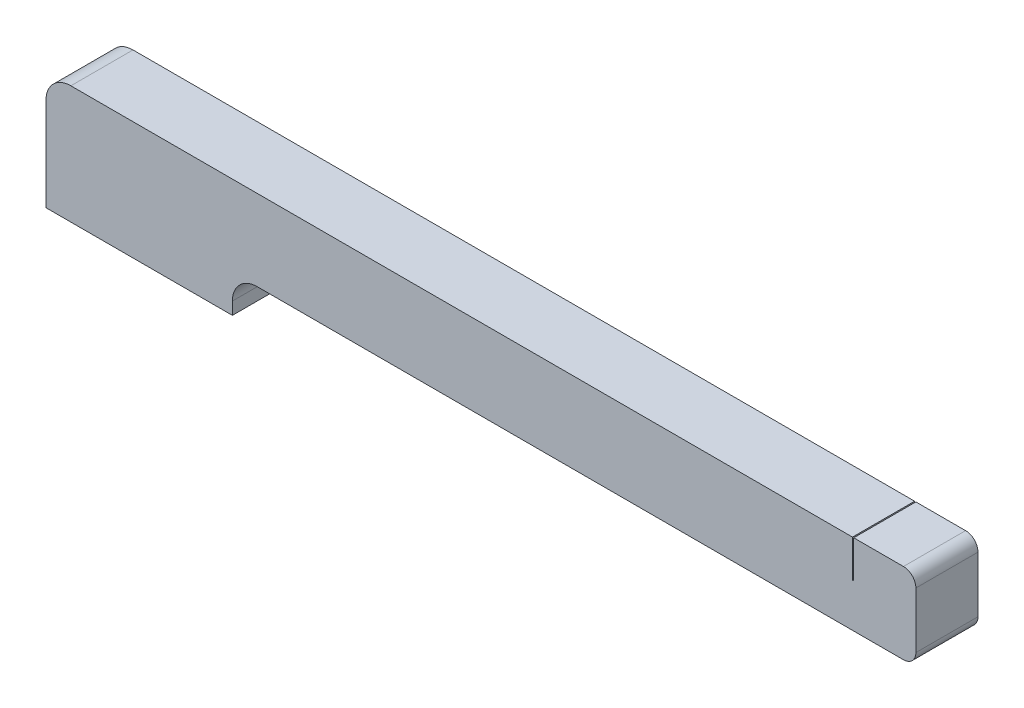
ISO-10303-21;
HEADER;
FILE_DESCRIPTION(('STEP AP214'),'2;1');
FILE_NAME('part.step','',(''),(''),'','','');
FILE_SCHEMA(('AUTOMOTIVE_DESIGN { 1 0 10303 214 1 1 1 1 }'));
ENDSEC;
DATA;
#1=APPLICATION_CONTEXT('core data for automotive mechanical design processes');
#2=APPLICATION_PROTOCOL_DEFINITION('international standard','automotive_design',2000,#1);
#3=PRODUCT_CONTEXT('',#1,'mechanical');
#4=PRODUCT('Part','Part','',(#3));
#5=PRODUCT_RELATED_PRODUCT_CATEGORY('part','',(#4));
#6=PRODUCT_DEFINITION_FORMATION('','',#4);
#7=PRODUCT_DEFINITION_CONTEXT('part definition',#1,'design');
#8=PRODUCT_DEFINITION('design','',#6,#7);
#9=PRODUCT_DEFINITION_SHAPE('','',#8);
#10=(LENGTH_UNIT() NAMED_UNIT(*) SI_UNIT(.MILLI.,.METRE.));
#11=(NAMED_UNIT(*) PLANE_ANGLE_UNIT() SI_UNIT($,.RADIAN.));
#12=(NAMED_UNIT(*) SI_UNIT($,.STERADIAN.) SOLID_ANGLE_UNIT());
#13=UNCERTAINTY_MEASURE_WITH_UNIT(LENGTH_MEASURE(1.E-05),#10,'distance_accuracy_value','');
#14=(GEOMETRIC_REPRESENTATION_CONTEXT(3) GLOBAL_UNCERTAINTY_ASSIGNED_CONTEXT((#13)) GLOBAL_UNIT_ASSIGNED_CONTEXT((#10,
#11,#12)) REPRESENTATION_CONTEXT('',''));
#15=CARTESIAN_POINT('',(0.,0.,0.));
#16=DIRECTION('',(0.,0.,1.));
#17=DIRECTION('',(1.,0.,0.));
#18=AXIS2_PLACEMENT_3D('',#15,#16,#17);
#19=CARTESIAN_POINT('',(2.,9.5,5.));
#20=DIRECTION('',(0.,-1.,0.));
#21=DIRECTION('',(0.,0.,-1.));
#22=AXIS2_PLACEMENT_3D('',#19,#20,#21);
#23=PLANE('',#22);
#24=DIRECTION('',(-1.,0.,0.));
#25=VECTOR('',#24,1.);
#26=CARTESIAN_POINT('',(2.,9.5,0.));
#27=LINE('',#26,#25);
#28=CARTESIAN_POINT('',(69.,9.5,0.));
#29=VERTEX_POINT('',#28);
#30=CARTESIAN_POINT('',(65.,9.5,0.));
#31=VERTEX_POINT('',#30);
#32=EDGE_CURVE('E194',#29,#31,#27,.T.);
#33=ORIENTED_EDGE('',*,*,#32,.T.);
#34=DIRECTION('',(0.,0.,-1.));
#35=VECTOR('',#34,1.);
#36=CARTESIAN_POINT('',(65.,9.5,5.));
#37=LINE('',#36,#35);
#38=CARTESIAN_POINT('',(65.,9.5,5.));
#39=VERTEX_POINT('',#38);
#40=EDGE_CURVE('E274',#39,#31,#37,.T.);
#41=ORIENTED_EDGE('',*,*,#40,.F.);
#42=DIRECTION('',(-1.,0.,0.));
#43=VECTOR('',#42,1.);
#44=CARTESIAN_POINT('',(2.,9.5,5.));
#45=LINE('',#44,#43);
#46=CARTESIAN_POINT('',(69.,9.5,5.));
#47=VERTEX_POINT('',#46);
#48=EDGE_CURVE('E148',#47,#39,#45,.T.);
#49=ORIENTED_EDGE('',*,*,#48,.F.);
#50=DIRECTION('',(0.,0.,-1.));
#51=VECTOR('',#50,1.);
#52=CARTESIAN_POINT('',(69.,9.5,5.));
#53=LINE('',#52,#51);
#54=EDGE_CURVE('E159',#47,#29,#53,.T.);
#55=ORIENTED_EDGE('',*,*,#54,.T.);
#56=EDGE_LOOP('',(#33,#41,#49,#55));
#57=FACE_BOUND('',#56,.T.);
#58=ADVANCED_FACE('F40',(#57),#23,.F.);
#59=CARTESIAN_POINT('',(15.,0.,5.));
#60=DIRECTION('',(0.,1.,0.));
#61=DIRECTION('',(-1.,0.,0.));
#62=AXIS2_PLACEMENT_3D('',#59,#60,#61);
#63=PLANE('',#62);
#64=DIRECTION('',(1.,0.,0.));
#65=VECTOR('',#64,1.);
#66=CARTESIAN_POINT('',(15.,0.,0.));
#67=LINE('',#66,#65);
#68=CARTESIAN_POINT('',(0.,0.,0.));
#69=VERTEX_POINT('',#68);
#70=CARTESIAN_POINT('',(15.,0.,0.));
#71=VERTEX_POINT('',#70);
#72=EDGE_CURVE('E104',#69,#71,#67,.T.);
#73=ORIENTED_EDGE('',*,*,#72,.T.);
#74=DIRECTION('',(0.,0.,-1.));
#75=VECTOR('',#74,1.);
#76=CARTESIAN_POINT('',(15.,0.,5.));
#77=LINE('',#76,#75);
#78=CARTESIAN_POINT('',(15.,0.,5.));
#79=VERTEX_POINT('',#78);
#80=EDGE_CURVE('E12',#79,#71,#77,.T.);
#81=ORIENTED_EDGE('',*,*,#80,.F.);
#82=DIRECTION('',(1.,0.,0.));
#83=VECTOR('',#82,1.);
#84=CARTESIAN_POINT('',(4.,0.,5.));
#85=LINE('',#84,#83);
#86=CARTESIAN_POINT('',(0.,0.,5.));
#87=VERTEX_POINT('',#86);
#88=EDGE_CURVE('E110',#87,#79,#85,.T.);
#89=ORIENTED_EDGE('',*,*,#88,.F.);
#90=DIRECTION('',(0.,0.,-1.));
#91=VECTOR('',#90,1.);
#92=CARTESIAN_POINT('',(0.,0.,5.));
#93=LINE('',#92,#91);
#94=EDGE_CURVE('E168',#87,#69,#93,.T.);
#95=ORIENTED_EDGE('',*,*,#94,.T.);
#96=EDGE_LOOP('',(#73,#81,#89,#95));
#97=FACE_BOUND('',#96,.T.);
#98=ADVANCED_FACE('F42',(#97),#63,.F.);
#99=CARTESIAN_POINT('',(15.,0.999999999999993,5.));
#100=DIRECTION('',(-1.,0.,0.));
#101=DIRECTION('',(0.,0.,1.));
#102=AXIS2_PLACEMENT_3D('',#99,#100,#101);
#103=PLANE('',#102);
#104=DIRECTION('',(0.,1.,0.));
#105=VECTOR('',#104,1.);
#106=CARTESIAN_POINT('',(15.,0.999999999999993,0.));
#107=LINE('',#106,#105);
#108=CARTESIAN_POINT('',(15.,0.999999999999993,0.));
#109=VERTEX_POINT('',#108);
#110=EDGE_CURVE('E175',#71,#109,#107,.T.);
#111=ORIENTED_EDGE('',*,*,#110,.T.);
#112=DIRECTION('',(0.,0.,-1.));
#113=VECTOR('',#112,1.);
#114=CARTESIAN_POINT('',(15.,0.999999999999993,5.));
#115=LINE('',#114,#113);
#116=CARTESIAN_POINT('',(15.,0.999999999999993,5.));
#117=VERTEX_POINT('',#116);
#118=EDGE_CURVE('E49',#117,#109,#115,.T.);
#119=ORIENTED_EDGE('',*,*,#118,.F.);
#120=DIRECTION('',(0.,1.,0.));
#121=VECTOR('',#120,1.);
#122=CARTESIAN_POINT('',(15.,0.999999999999993,5.));
#123=LINE('',#122,#121);
#124=EDGE_CURVE('E303',#79,#117,#123,.T.);
#125=ORIENTED_EDGE('',*,*,#124,.F.);
#126=ORIENTED_EDGE('',*,*,#80,.T.);
#127=EDGE_LOOP('',(#111,#119,#125,#126));
#128=FACE_BOUND('',#127,.T.);
#129=ADVANCED_FACE('F306',(#128),#103,.F.);
#130=CARTESIAN_POINT('',(17.,0.999999999999993,5.));
#131=DIRECTION('',(0.,0.,-1.));
#132=DIRECTION('',(-1.,0.,0.));
#133=AXIS2_PLACEMENT_3D('',#130,#131,#132);
#134=CYLINDRICAL_SURFACE('',#133,2.);
#135=CARTESIAN_POINT('',(17.,0.999999999999993,0.));
#136=DIRECTION('',(0.,0.,-1.));
#137=DIRECTION('',(1.,0.,0.));
#138=AXIS2_PLACEMENT_3D('',#135,#136,#137);
#139=CIRCLE('',#138,2.);
#140=CARTESIAN_POINT('',(17.,2.99999999999999,0.));
#141=VERTEX_POINT('',#140);
#142=EDGE_CURVE('E179',#109,#141,#139,.T.);
#143=ORIENTED_EDGE('',*,*,#142,.T.);
#144=DIRECTION('',(0.,0.,-1.));
#145=VECTOR('',#144,1.);
#146=CARTESIAN_POINT('',(17.,2.99999999999999,5.));
#147=LINE('',#146,#145);
#148=CARTESIAN_POINT('',(17.,2.99999999999999,5.));
#149=VERTEX_POINT('',#148);
#150=EDGE_CURVE('E224',#149,#141,#147,.T.);
#151=ORIENTED_EDGE('',*,*,#150,.F.);
#152=CARTESIAN_POINT('',(17.,0.999999999999993,5.));
#153=DIRECTION('',(0.,0.,-1.));
#154=DIRECTION('',(1.,0.,0.));
#155=AXIS2_PLACEMENT_3D('',#152,#153,#154);
#156=CIRCLE('',#155,2.);
#157=EDGE_CURVE('E235',#117,#149,#156,.T.);
#158=ORIENTED_EDGE('',*,*,#157,.F.);
#159=ORIENTED_EDGE('',*,*,#118,.T.);
#160=EDGE_LOOP('',(#143,#151,#158,#159));
#161=FACE_BOUND('',#160,.T.);
#162=ADVANCED_FACE('F233',(#161),#134,.F.);
#163=CARTESIAN_POINT('',(69.,3.,5.));
#164=DIRECTION('',(0.,1.,0.));
#165=DIRECTION('',(-1.,0.,0.));
#166=AXIS2_PLACEMENT_3D('',#163,#164,#165);
#167=PLANE('',#166);
#168=DIRECTION('',(1.,0.,0.));
#169=VECTOR('',#168,1.);
#170=CARTESIAN_POINT('',(69.,3.,0.));
#171=LINE('',#170,#169);
#172=CARTESIAN_POINT('',(69.,3.,0.));
#173=VERTEX_POINT('',#172);
#174=EDGE_CURVE('E182',#141,#173,#171,.T.);
#175=ORIENTED_EDGE('',*,*,#174,.T.);
#176=DIRECTION('',(0.,0.,-1.));
#177=VECTOR('',#176,1.);
#178=CARTESIAN_POINT('',(69.,3.,5.));
#179=LINE('',#178,#177);
#180=CARTESIAN_POINT('',(69.,3.,5.));
#181=VERTEX_POINT('',#180);
#182=EDGE_CURVE('E220',#181,#173,#179,.T.);
#183=ORIENTED_EDGE('',*,*,#182,.F.);
#184=DIRECTION('',(1.,0.,0.));
#185=VECTOR('',#184,1.);
#186=CARTESIAN_POINT('',(69.,3.,5.));
#187=LINE('',#186,#185);
#188=EDGE_CURVE('E255',#149,#181,#187,.T.);
#189=ORIENTED_EDGE('',*,*,#188,.F.);
#190=ORIENTED_EDGE('',*,*,#150,.T.);
#191=EDGE_LOOP('',(#175,#183,#189,#190));
#192=FACE_BOUND('',#191,.T.);
#193=ADVANCED_FACE('F245',(#192),#167,.F.);
#194=CARTESIAN_POINT('',(69.,4.,5.));
#195=DIRECTION('',(0.,0.,-1.));
#196=DIRECTION('',(-1.,0.,0.));
#197=AXIS2_PLACEMENT_3D('',#194,#195,#196);
#198=CYLINDRICAL_SURFACE('',#197,1.);
#199=CARTESIAN_POINT('',(69.,4.,0.));
#200=DIRECTION('',(0.,0.,1.));
#201=DIRECTION('',(1.,0.,0.));
#202=AXIS2_PLACEMENT_3D('',#199,#200,#201);
#203=CIRCLE('',#202,1.);
#204=CARTESIAN_POINT('',(70.,4.,0.));
#205=VERTEX_POINT('',#204);
#206=EDGE_CURVE('E185',#173,#205,#203,.T.);
#207=ORIENTED_EDGE('',*,*,#206,.T.);
#208=DIRECTION('',(0.,0.,-1.));
#209=VECTOR('',#208,1.);
#210=CARTESIAN_POINT('',(70.,4.,5.));
#211=LINE('',#210,#209);
#212=CARTESIAN_POINT('',(70.,4.,5.));
#213=VERTEX_POINT('',#212);
#214=EDGE_CURVE('E216',#213,#205,#211,.T.);
#215=ORIENTED_EDGE('',*,*,#214,.F.);
#216=CARTESIAN_POINT('',(69.,4.,5.));
#217=DIRECTION('',(0.,0.,1.));
#218=DIRECTION('',(1.,0.,0.));
#219=AXIS2_PLACEMENT_3D('',#216,#217,#218);
#220=CIRCLE('',#219,1.);
#221=EDGE_CURVE('E251',#181,#213,#220,.T.);
#222=ORIENTED_EDGE('',*,*,#221,.F.);
#223=ORIENTED_EDGE('',*,*,#182,.T.);
#224=EDGE_LOOP('',(#207,#215,#222,#223));
#225=FACE_BOUND('',#224,.T.);
#226=ADVANCED_FACE('F249',(#225),#198,.T.);
#227=CARTESIAN_POINT('',(70.,8.5,5.));
#228=DIRECTION('',(-1.,0.,0.));
#229=DIRECTION('',(0.,0.,1.));
#230=AXIS2_PLACEMENT_3D('',#227,#228,#229);
#231=PLANE('',#230);
#232=DIRECTION('',(0.,1.,0.));
#233=VECTOR('',#232,1.);
#234=CARTESIAN_POINT('',(70.,8.5,0.));
#235=LINE('',#234,#233);
#236=CARTESIAN_POINT('',(70.,8.5,0.));
#237=VERTEX_POINT('',#236);
#238=EDGE_CURVE('E188',#205,#237,#235,.T.);
#239=ORIENTED_EDGE('',*,*,#238,.T.);
#240=DIRECTION('',(0.,0.,-1.));
#241=VECTOR('',#240,1.);
#242=CARTESIAN_POINT('',(70.,8.5,5.));
#243=LINE('',#242,#241);
#244=CARTESIAN_POINT('',(70.,8.5,5.));
#245=VERTEX_POINT('',#244);
#246=EDGE_CURVE('E212',#245,#237,#243,.T.);
#247=ORIENTED_EDGE('',*,*,#246,.F.);
#248=DIRECTION('',(0.,1.,0.));
#249=VECTOR('',#248,1.);
#250=CARTESIAN_POINT('',(70.,8.5,5.));
#251=LINE('',#250,#249);
#252=EDGE_CURVE('E254',#213,#245,#251,.T.);
#253=ORIENTED_EDGE('',*,*,#252,.F.);
#254=ORIENTED_EDGE('',*,*,#214,.T.);
#255=EDGE_LOOP('',(#239,#247,#253,#254));
#256=FACE_BOUND('',#255,.T.);
#257=ADVANCED_FACE('F353',(#256),#231,.F.);
#258=CARTESIAN_POINT('',(69.,8.5,5.));
#259=DIRECTION('',(0.,0.,-1.));
#260=DIRECTION('',(-1.,0.,0.));
#261=AXIS2_PLACEMENT_3D('',#258,#259,#260);
#262=CYLINDRICAL_SURFACE('',#261,1.);
#263=CARTESIAN_POINT('',(69.,8.5,0.));
#264=DIRECTION('',(0.,0.,1.));
#265=DIRECTION('',(1.,0.,0.));
#266=AXIS2_PLACEMENT_3D('',#263,#264,#265);
#267=CIRCLE('',#266,1.);
#268=EDGE_CURVE('E191',#237,#29,#267,.T.);
#269=ORIENTED_EDGE('',*,*,#268,.T.);
#270=ORIENTED_EDGE('',*,*,#54,.F.);
#271=CARTESIAN_POINT('',(69.,8.5,5.));
#272=DIRECTION('',(0.,0.,1.));
#273=DIRECTION('',(1.,0.,0.));
#274=AXIS2_PLACEMENT_3D('',#271,#272,#273);
#275=CIRCLE('',#274,1.);
#276=EDGE_CURVE('E149',#245,#47,#275,.T.);
#277=ORIENTED_EDGE('',*,*,#276,.F.);
#278=ORIENTED_EDGE('',*,*,#246,.T.);
#279=EDGE_LOOP('',(#269,#270,#277,#278));
#280=FACE_BOUND('',#279,.T.);
#281=ADVANCED_FACE('F268',(#280),#262,.T.);
#282=CARTESIAN_POINT('',(64.9,9.5,5.));
#283=VERTEX_POINT('',#282);
#284=CARTESIAN_POINT('',(2.,9.5,5.));
#285=VERTEX_POINT('',#284);
#286=EDGE_CURVE('E134',#283,#285,#45,.T.);
#287=ORIENTED_EDGE('',*,*,#286,.F.);
#288=DIRECTION('',(0.,0.,1.));
#289=VECTOR('',#288,1.);
#290=CARTESIAN_POINT('',(64.9,9.5,5.));
#291=LINE('',#290,#289);
#292=CARTESIAN_POINT('',(64.9,9.5,0.));
#293=VERTEX_POINT('',#292);
#294=EDGE_CURVE('E281',#293,#283,#291,.T.);
#295=ORIENTED_EDGE('',*,*,#294,.F.);
#296=CARTESIAN_POINT('',(2.,9.5,0.));
#297=VERTEX_POINT('',#296);
#298=EDGE_CURVE('E155',#293,#297,#27,.T.);
#299=ORIENTED_EDGE('',*,*,#298,.T.);
#300=DIRECTION('',(0.,0.,-1.));
#301=VECTOR('',#300,1.);
#302=CARTESIAN_POINT('',(2.,9.5,5.));
#303=LINE('',#302,#301);
#304=EDGE_CURVE('E152',#285,#297,#303,.T.);
#305=ORIENTED_EDGE('',*,*,#304,.F.);
#306=EDGE_LOOP('',(#287,#295,#299,#305));
#307=FACE_BOUND('',#306,.T.);
#308=ADVANCED_FACE('F153',(#307),#23,.F.);
#309=CARTESIAN_POINT('',(2.,7.5,5.));
#310=DIRECTION('',(0.,0.,-1.));
#311=DIRECTION('',(-1.,0.,0.));
#312=AXIS2_PLACEMENT_3D('',#309,#310,#311);
#313=CYLINDRICAL_SURFACE('',#312,2.);
#314=CARTESIAN_POINT('',(2.,7.5,0.));
#315=DIRECTION('',(0.,0.,1.));
#316=DIRECTION('',(1.,0.,0.));
#317=AXIS2_PLACEMENT_3D('',#314,#315,#316);
#318=CIRCLE('',#317,2.);
#319=CARTESIAN_POINT('',(0.,7.5,0.));
#320=VERTEX_POINT('',#319);
#321=EDGE_CURVE('E198',#297,#320,#318,.T.);
#322=ORIENTED_EDGE('',*,*,#321,.T.);
#323=DIRECTION('',(0.,0.,-1.));
#324=VECTOR('',#323,1.);
#325=CARTESIAN_POINT('',(0.,7.5,5.));
#326=LINE('',#325,#324);
#327=CARTESIAN_POINT('',(0.,7.5,5.));
#328=VERTEX_POINT('',#327);
#329=EDGE_CURVE('E160',#328,#320,#326,.T.);
#330=ORIENTED_EDGE('',*,*,#329,.F.);
#331=CARTESIAN_POINT('',(2.,7.5,5.));
#332=DIRECTION('',(0.,0.,1.));
#333=DIRECTION('',(1.,0.,0.));
#334=AXIS2_PLACEMENT_3D('',#331,#332,#333);
#335=CIRCLE('',#334,2.);
#336=EDGE_CURVE('E139',#285,#328,#335,.T.);
#337=ORIENTED_EDGE('',*,*,#336,.F.);
#338=ORIENTED_EDGE('',*,*,#304,.T.);
#339=EDGE_LOOP('',(#322,#330,#337,#338));
#340=FACE_BOUND('',#339,.T.);
#341=ADVANCED_FACE('F162',(#340),#313,.T.);
#342=CARTESIAN_POINT('',(0.,0.,5.));
#343=DIRECTION('',(1.,0.,0.));
#344=DIRECTION('',(0.,0.,-1.));
#345=AXIS2_PLACEMENT_3D('',#342,#343,#344);
#346=PLANE('',#345);
#347=DIRECTION('',(0.,-1.,0.));
#348=VECTOR('',#347,1.);
#349=CARTESIAN_POINT('',(0.,0.,0.));
#350=LINE('',#349,#348);
#351=EDGE_CURVE('E201',#320,#69,#350,.T.);
#352=ORIENTED_EDGE('',*,*,#351,.T.);
#353=ORIENTED_EDGE('',*,*,#94,.F.);
#354=DIRECTION('',(0.,-1.,0.));
#355=VECTOR('',#354,1.);
#356=CARTESIAN_POINT('',(0.,0.,5.));
#357=LINE('',#356,#355);
#358=EDGE_CURVE('E65',#328,#87,#357,.T.);
#359=ORIENTED_EDGE('',*,*,#358,.F.);
#360=ORIENTED_EDGE('',*,*,#329,.T.);
#361=EDGE_LOOP('',(#352,#353,#359,#360));
#362=FACE_BOUND('',#361,.T.);
#363=ADVANCED_FACE('F309',(#362),#346,.F.);
#364=CARTESIAN_POINT('',(2.,7.5,5.));
#365=DIRECTION('',(0.,0.,1.));
#366=DIRECTION('',(1.,0.,0.));
#367=AXIS2_PLACEMENT_3D('',#364,#365,#366);
#368=PLANE('',#367);
#369=DIRECTION('',(0.,1.,0.));
#370=VECTOR('',#369,1.);
#371=CARTESIAN_POINT('',(65.,6.5,5.));
#372=LINE('',#371,#370);
#373=CARTESIAN_POINT('',(65.,6.5,5.));
#374=VERTEX_POINT('',#373);
#375=EDGE_CURVE('E176',#374,#39,#372,.T.);
#376=ORIENTED_EDGE('',*,*,#375,.F.);
#377=DIRECTION('',(1.,0.,0.));
#378=VECTOR('',#377,1.);
#379=CARTESIAN_POINT('',(64.9,6.5,5.));
#380=LINE('',#379,#378);
#381=CARTESIAN_POINT('',(64.9,6.5,5.));
#382=VERTEX_POINT('',#381);
#383=EDGE_CURVE('E287',#382,#374,#380,.T.);
#384=ORIENTED_EDGE('',*,*,#383,.F.);
#385=DIRECTION('',(0.,1.,0.));
#386=VECTOR('',#385,1.);
#387=CARTESIAN_POINT('',(64.9,6.5,5.));
#388=LINE('',#387,#386);
#389=EDGE_CURVE('E144',#382,#283,#388,.T.);
#390=ORIENTED_EDGE('',*,*,#389,.T.);
#391=ORIENTED_EDGE('',*,*,#286,.T.);
#392=ORIENTED_EDGE('',*,*,#336,.T.);
#393=ORIENTED_EDGE('',*,*,#358,.T.);
#394=ORIENTED_EDGE('',*,*,#88,.T.);
#395=ORIENTED_EDGE('',*,*,#124,.T.);
#396=ORIENTED_EDGE('',*,*,#157,.T.);
#397=ORIENTED_EDGE('',*,*,#188,.T.);
#398=ORIENTED_EDGE('',*,*,#221,.T.);
#399=ORIENTED_EDGE('',*,*,#252,.T.);
#400=ORIENTED_EDGE('',*,*,#276,.T.);
#401=ORIENTED_EDGE('',*,*,#48,.T.);
#402=EDGE_LOOP('',(#376,#384,#390,#391,#392,#393,#394,#395,#396,#397,#398,#399,#400,#401));
#403=FACE_BOUND('',#402,.T.);
#404=ADVANCED_FACE('F137',(#403),#368,.T.);
#405=CARTESIAN_POINT('',(2.,7.5,0.));
#406=DIRECTION('',(0.,0.,1.));
#407=DIRECTION('',(1.,0.,0.));
#408=AXIS2_PLACEMENT_3D('',#405,#406,#407);
#409=PLANE('',#408);
#410=DIRECTION('',(-1.,0.,0.));
#411=VECTOR('',#410,1.);
#412=CARTESIAN_POINT('',(64.9,6.5,0.));
#413=LINE('',#412,#411);
#414=CARTESIAN_POINT('',(65.,6.5,0.));
#415=VERTEX_POINT('',#414);
#416=CARTESIAN_POINT('',(64.9,6.5,0.));
#417=VERTEX_POINT('',#416);
#418=EDGE_CURVE('E319',#415,#417,#413,.T.);
#419=ORIENTED_EDGE('',*,*,#418,.F.);
#420=DIRECTION('',(0.,1.,0.));
#421=VECTOR('',#420,1.);
#422=CARTESIAN_POINT('',(65.,6.5,0.));
#423=LINE('',#422,#421);
#424=EDGE_CURVE('E298',#415,#31,#423,.T.);
#425=ORIENTED_EDGE('',*,*,#424,.T.);
#426=ORIENTED_EDGE('',*,*,#32,.F.);
#427=ORIENTED_EDGE('',*,*,#268,.F.);
#428=ORIENTED_EDGE('',*,*,#238,.F.);
#429=ORIENTED_EDGE('',*,*,#206,.F.);
#430=ORIENTED_EDGE('',*,*,#174,.F.);
#431=ORIENTED_EDGE('',*,*,#142,.F.);
#432=ORIENTED_EDGE('',*,*,#110,.F.);
#433=ORIENTED_EDGE('',*,*,#72,.F.);
#434=ORIENTED_EDGE('',*,*,#351,.F.);
#435=ORIENTED_EDGE('',*,*,#321,.F.);
#436=ORIENTED_EDGE('',*,*,#298,.F.);
#437=DIRECTION('',(0.,1.,0.));
#438=VECTOR('',#437,1.);
#439=CARTESIAN_POINT('',(64.9,6.5,0.));
#440=LINE('',#439,#438);
#441=EDGE_CURVE('E294',#417,#293,#440,.T.);
#442=ORIENTED_EDGE('',*,*,#441,.F.);
#443=EDGE_LOOP('',(#419,#425,#426,#427,#428,#429,#430,#431,#432,#433,#434,#435,#436,#442));
#444=FACE_BOUND('',#443,.T.);
#445=ADVANCED_FACE('F240',(#444),#409,.F.);
#446=CARTESIAN_POINT('',(65.,6.5,5.));
#447=DIRECTION('',(1.,0.,0.));
#448=DIRECTION('',(0.,0.,-1.));
#449=AXIS2_PLACEMENT_3D('',#446,#447,#448);
#450=PLANE('',#449);
#451=ORIENTED_EDGE('',*,*,#40,.T.);
#452=ORIENTED_EDGE('',*,*,#424,.F.);
#453=DIRECTION('',(0.,0.,-1.));
#454=VECTOR('',#453,1.);
#455=CARTESIAN_POINT('',(65.,6.5,5.));
#456=LINE('',#455,#454);
#457=EDGE_CURVE('E56',#374,#415,#456,.T.);
#458=ORIENTED_EDGE('',*,*,#457,.F.);
#459=ORIENTED_EDGE('',*,*,#375,.T.);
#460=EDGE_LOOP('',(#451,#452,#458,#459));
#461=FACE_BOUND('',#460,.T.);
#462=ADVANCED_FACE('F328',(#461),#450,.F.);
#463=CARTESIAN_POINT('',(64.9,6.5,5.));
#464=DIRECTION('',(-1.,0.,0.));
#465=DIRECTION('',(0.,0.,1.));
#466=AXIS2_PLACEMENT_3D('',#463,#464,#465);
#467=PLANE('',#466);
#468=ORIENTED_EDGE('',*,*,#294,.T.);
#469=ORIENTED_EDGE('',*,*,#389,.F.);
#470=DIRECTION('',(0.,0.,1.));
#471=VECTOR('',#470,1.);
#472=CARTESIAN_POINT('',(64.9,6.5,5.));
#473=LINE('',#472,#471);
#474=EDGE_CURVE('E316',#417,#382,#473,.T.);
#475=ORIENTED_EDGE('',*,*,#474,.F.);
#476=ORIENTED_EDGE('',*,*,#441,.T.);
#477=EDGE_LOOP('',(#468,#469,#475,#476));
#478=FACE_BOUND('',#477,.T.);
#479=ADVANCED_FACE('F332',(#478),#467,.F.);
#480=CARTESIAN_POINT('',(0.,6.5,0.));
#481=DIRECTION('',(0.,-1.,0.));
#482=DIRECTION('',(0.,0.,-1.));
#483=AXIS2_PLACEMENT_3D('',#480,#481,#482);
#484=PLANE('',#483);
#485=ORIENTED_EDGE('',*,*,#457,.T.);
#486=ORIENTED_EDGE('',*,*,#418,.T.);
#487=ORIENTED_EDGE('',*,*,#474,.T.);
#488=ORIENTED_EDGE('',*,*,#383,.T.);
#489=EDGE_LOOP('',(#485,#486,#487,#488));
#490=FACE_BOUND('',#489,.T.);
#491=ADVANCED_FACE('F323',(#490),#484,.F.);
#492=CLOSED_SHELL('',(#58,#98,#129,#162,#193,#226,#257,#281,#308,#341,#363,#404,#445,#462,#479,#491));
#493=MANIFOLD_SOLID_BREP('B2',#492);
#494=ADVANCED_BREP_SHAPE_REPRESENTATION('',(#18,#493),#14);
#495=SHAPE_DEFINITION_REPRESENTATION(#9,#494);
ENDSEC;
END-ISO-10303-21;
